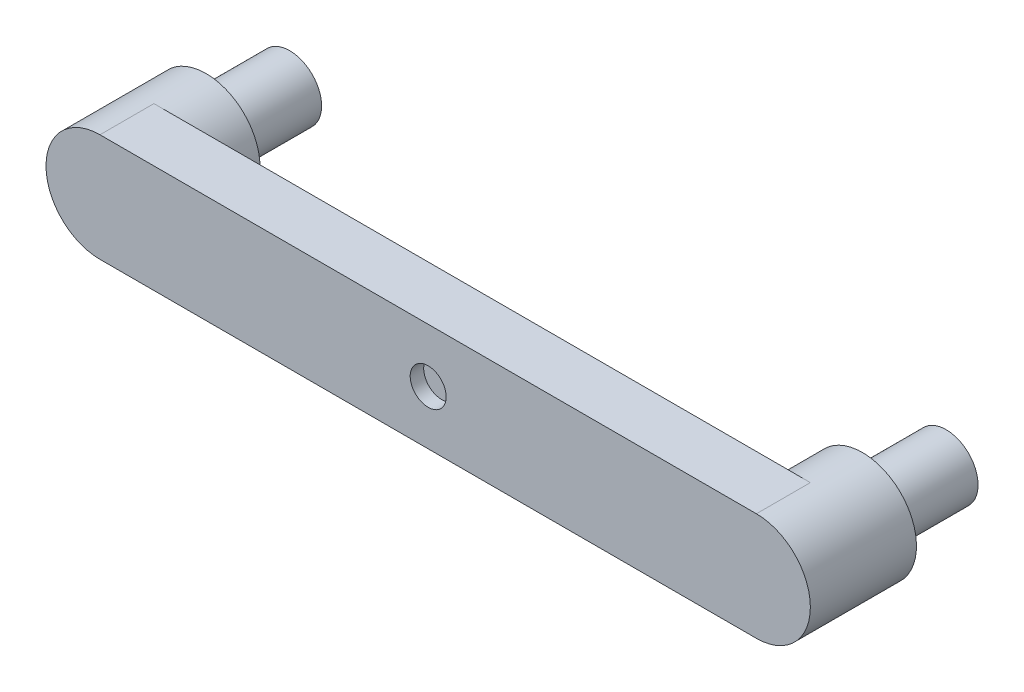
ISO-10303-21;
HEADER;
FILE_DESCRIPTION(('STEP AP214'),'2;1');
FILE_NAME('part.step','',(''),(''),'','','');
FILE_SCHEMA(('AUTOMOTIVE_DESIGN { 1 0 10303 214 1 1 1 1 }'));
ENDSEC;
DATA;
#1=APPLICATION_CONTEXT('core data for automotive mechanical design processes');
#2=APPLICATION_PROTOCOL_DEFINITION('international standard','automotive_design',2000,#1);
#3=PRODUCT_CONTEXT('',#1,'mechanical');
#4=PRODUCT('Part','Part','',(#3));
#5=PRODUCT_RELATED_PRODUCT_CATEGORY('part','',(#4));
#6=PRODUCT_DEFINITION_FORMATION('','',#4);
#7=PRODUCT_DEFINITION_CONTEXT('part definition',#1,'design');
#8=PRODUCT_DEFINITION('design','',#6,#7);
#9=PRODUCT_DEFINITION_SHAPE('','',#8);
#10=(LENGTH_UNIT() NAMED_UNIT(*) SI_UNIT(.MILLI.,.METRE.));
#11=(NAMED_UNIT(*) PLANE_ANGLE_UNIT() SI_UNIT($,.RADIAN.));
#12=(NAMED_UNIT(*) SI_UNIT($,.STERADIAN.) SOLID_ANGLE_UNIT());
#13=UNCERTAINTY_MEASURE_WITH_UNIT(LENGTH_MEASURE(1.E-05),#10,'distance_accuracy_value','');
#14=(GEOMETRIC_REPRESENTATION_CONTEXT(3) GLOBAL_UNCERTAINTY_ASSIGNED_CONTEXT((#13)) GLOBAL_UNIT_ASSIGNED_CONTEXT((#10,
#11,#12)) REPRESENTATION_CONTEXT('',''));
#15=CARTESIAN_POINT('',(0.,0.,0.));
#16=DIRECTION('',(0.,0.,1.));
#17=DIRECTION('',(1.,0.,0.));
#18=AXIS2_PLACEMENT_3D('',#15,#16,#17);
#19=CARTESIAN_POINT('',(0.,0.,-58.2842712474619));
#20=DIRECTION('',(0.,0.,1.));
#21=DIRECTION('',(1.,0.,0.));
#22=AXIS2_PLACEMENT_3D('',#19,#20,#21);
#23=CYLINDRICAL_SURFACE('',#22,10.);
#24=CARTESIAN_POINT('',(0.,0.,-7.50000000000001));
#25=DIRECTION('',(0.,0.,1.));
#26=DIRECTION('',(1.,0.,0.));
#27=AXIS2_PLACEMENT_3D('',#24,#25,#26);
#28=CIRCLE('',#27,10.);
#29=CARTESIAN_POINT('',(10.,0.,-7.50000000000001));
#30=VERTEX_POINT('',#29);
#31=EDGE_CURVE('E45',#30,#30,#28,.F.);
#32=ORIENTED_EDGE('',*,*,#31,.T.);
#33=EDGE_LOOP('',(#32));
#34=FACE_BOUND('',#33,.T.);
#35=CARTESIAN_POINT('',(0.,0.,0.));
#36=DIRECTION('',(0.,0.,1.));
#37=DIRECTION('',(1.,0.,0.));
#38=AXIS2_PLACEMENT_3D('',#35,#36,#37);
#39=CIRCLE('',#38,10.);
#40=CARTESIAN_POINT('',(10.,0.,0.));
#41=VERTEX_POINT('',#40);
#42=EDGE_CURVE('E170',#41,#41,#39,.T.);
#43=ORIENTED_EDGE('',*,*,#42,.T.);
#44=EDGE_LOOP('',(#43));
#45=FACE_BOUND('',#44,.T.);
#46=ADVANCED_FACE('F41',(#34,#45),#23,.F.);
#47=CARTESIAN_POINT('',(0.,-30.,-30.));
#48=DIRECTION('',(0.,-1.,0.));
#49=DIRECTION('',(1.,0.,0.));
#50=AXIS2_PLACEMENT_3D('',#47,#48,#49);
#51=PLANE('',#50);
#52=DIRECTION('',(0.,0.,-1.));
#53=VECTOR('',#52,1.);
#54=CARTESIAN_POINT('',(-30.,-30.,-22.5));
#55=LINE('',#54,#53);
#56=CARTESIAN_POINT('',(-30.,-30.,-7.50000000000001));
#57=VERTEX_POINT('',#56);
#58=CARTESIAN_POINT('',(-30.,-30.,-22.5));
#59=VERTEX_POINT('',#58);
#60=EDGE_CURVE('E59',#57,#59,#55,.T.);
#61=ORIENTED_EDGE('',*,*,#60,.F.);
#62=DIRECTION('',(-1.,0.,0.));
#63=VECTOR('',#62,1.);
#64=CARTESIAN_POINT('',(-30.,-30.,-7.50000000000001));
#65=LINE('',#64,#63);
#66=CARTESIAN_POINT('',(30.,-30.,-7.50000000000001));
#67=VERTEX_POINT('',#66);
#68=EDGE_CURVE('E153',#67,#57,#65,.T.);
#69=ORIENTED_EDGE('',*,*,#68,.F.);
#70=DIRECTION('',(0.,0.,1.));
#71=VECTOR('',#70,1.);
#72=CARTESIAN_POINT('',(30.,-30.,-22.5));
#73=LINE('',#72,#71);
#74=CARTESIAN_POINT('',(30.,-30.,-22.5));
#75=VERTEX_POINT('',#74);
#76=EDGE_CURVE('E242',#75,#67,#73,.T.);
#77=ORIENTED_EDGE('',*,*,#76,.F.);
#78=DIRECTION('',(1.,0.,0.));
#79=VECTOR('',#78,1.);
#80=CARTESIAN_POINT('',(-30.,-30.,-22.5));
#81=LINE('',#80,#79);
#82=EDGE_CURVE('E250',#59,#75,#81,.T.);
#83=ORIENTED_EDGE('',*,*,#82,.F.);
#84=EDGE_LOOP('',(#61,#69,#77,#83));
#85=FACE_BOUND('',#84,.T.);
#86=DIRECTION('',(1.,0.,0.));
#87=VECTOR('',#86,1.);
#88=CARTESIAN_POINT('',(0.,-30.,0.));
#89=LINE('',#88,#87);
#90=CARTESIAN_POINT('',(-182.5,-30.,0.));
#91=VERTEX_POINT('',#90);
#92=CARTESIAN_POINT('',(182.5,-29.9999999999999,0.));
#93=VERTEX_POINT('',#92);
#94=EDGE_CURVE('E102',#91,#93,#89,.T.);
#95=ORIENTED_EDGE('',*,*,#94,.F.);
#96=DIRECTION('',(0.,0.,1.));
#97=VECTOR('',#96,1.);
#98=CARTESIAN_POINT('',(-182.5,-30.,-30.));
#99=LINE('',#98,#97);
#100=CARTESIAN_POINT('',(-182.5,-30.,-30.));
#101=VERTEX_POINT('',#100);
#102=EDGE_CURVE('E88',#101,#91,#99,.T.);
#103=ORIENTED_EDGE('',*,*,#102,.F.);
#104=DIRECTION('',(1.,0.,0.));
#105=VECTOR('',#104,1.);
#106=CARTESIAN_POINT('',(0.,-30.,-30.));
#107=LINE('',#106,#105);
#108=CARTESIAN_POINT('',(182.5,-29.9999999999999,-30.));
#109=VERTEX_POINT('',#108);
#110=EDGE_CURVE('E117',#101,#109,#107,.T.);
#111=ORIENTED_EDGE('',*,*,#110,.T.);
#112=DIRECTION('',(0.,0.,1.));
#113=VECTOR('',#112,1.);
#114=CARTESIAN_POINT('',(182.5,-29.9999999999999,-30.));
#115=LINE('',#114,#113);
#116=EDGE_CURVE('E104',#109,#93,#115,.T.);
#117=ORIENTED_EDGE('',*,*,#116,.T.);
#118=EDGE_LOOP('',(#95,#103,#111,#117));
#119=FACE_BOUND('',#118,.T.);
#120=ADVANCED_FACE('F43',(#85,#119),#51,.T.);
#121=CARTESIAN_POINT('',(-182.5,0.,-30.));
#122=DIRECTION('',(0.,0.,1.));
#123=DIRECTION('',(1.,0.,0.));
#124=AXIS2_PLACEMENT_3D('',#121,#122,#123);
#125=CYLINDRICAL_SURFACE('',#124,30.);
#126=CARTESIAN_POINT('',(-182.5,0.,0.));
#127=DIRECTION('',(0.,0.,1.));
#128=DIRECTION('',(1.,0.,0.));
#129=AXIS2_PLACEMENT_3D('',#126,#127,#128);
#130=CIRCLE('',#129,30.);
#131=CARTESIAN_POINT('',(-182.5,30.,0.));
#132=VERTEX_POINT('',#131);
#133=EDGE_CURVE('E93',#132,#91,#130,.T.);
#134=ORIENTED_EDGE('',*,*,#133,.F.);
#135=DIRECTION('',(0.,0.,1.));
#136=VECTOR('',#135,1.);
#137=CARTESIAN_POINT('',(-182.5,30.,-30.));
#138=LINE('',#137,#136);
#139=CARTESIAN_POINT('',(-182.5,30.,-30.));
#140=VERTEX_POINT('',#139);
#141=EDGE_CURVE('E99',#140,#132,#138,.T.);
#142=ORIENTED_EDGE('',*,*,#141,.F.);
#143=CARTESIAN_POINT('',(-182.5,0.,-30.));
#144=DIRECTION('',(0.,0.,-1.));
#145=DIRECTION('',(-1.,0.,0.));
#146=AXIS2_PLACEMENT_3D('',#143,#144,#145);
#147=CIRCLE('',#146,30.);
#148=EDGE_CURVE('E68',#140,#101,#147,.T.);
#149=ORIENTED_EDGE('',*,*,#148,.T.);
#150=ORIENTED_EDGE('',*,*,#102,.T.);
#151=EDGE_LOOP('',(#134,#142,#149,#150));
#152=FACE_BOUND('',#151,.T.);
#153=CARTESIAN_POINT('',(-182.5,0.,-59.));
#154=DIRECTION('',(0.,0.,-1.));
#155=DIRECTION('',(-1.,0.,0.));
#156=AXIS2_PLACEMENT_3D('',#153,#154,#155);
#157=CIRCLE('',#156,30.);
#158=CARTESIAN_POINT('',(-212.5,0.,-59.));
#159=VERTEX_POINT('',#158);
#160=EDGE_CURVE('E181',#159,#159,#157,.T.);
#161=ORIENTED_EDGE('',*,*,#160,.F.);
#162=EDGE_LOOP('',(#161));
#163=FACE_BOUND('',#162,.T.);
#164=ADVANCED_FACE('F90',(#152,#163),#125,.T.);
#165=CARTESIAN_POINT('',(0.,30.,-30.));
#166=DIRECTION('',(0.,-1.,0.));
#167=DIRECTION('',(1.,0.,0.));
#168=AXIS2_PLACEMENT_3D('',#165,#166,#167);
#169=PLANE('',#168);
#170=DIRECTION('',(1.,0.,0.));
#171=VECTOR('',#170,1.);
#172=CARTESIAN_POINT('',(0.,30.,0.));
#173=LINE('',#172,#171);
#174=CARTESIAN_POINT('',(182.5,30.0000000000001,0.));
#175=VERTEX_POINT('',#174);
#176=EDGE_CURVE('E115',#132,#175,#173,.T.);
#177=ORIENTED_EDGE('',*,*,#176,.T.);
#178=DIRECTION('',(0.,0.,1.));
#179=VECTOR('',#178,1.);
#180=CARTESIAN_POINT('',(182.5,30.0000000000001,-30.));
#181=LINE('',#180,#179);
#182=CARTESIAN_POINT('',(182.5,30.0000000000001,-30.));
#183=VERTEX_POINT('',#182);
#184=EDGE_CURVE('E128',#183,#175,#181,.T.);
#185=ORIENTED_EDGE('',*,*,#184,.F.);
#186=DIRECTION('',(1.,0.,0.));
#187=VECTOR('',#186,1.);
#188=CARTESIAN_POINT('',(0.,30.,-30.));
#189=LINE('',#188,#187);
#190=EDGE_CURVE('E121',#140,#183,#189,.T.);
#191=ORIENTED_EDGE('',*,*,#190,.F.);
#192=ORIENTED_EDGE('',*,*,#141,.T.);
#193=EDGE_LOOP('',(#177,#185,#191,#192));
#194=FACE_BOUND('',#193,.T.);
#195=ADVANCED_FACE('F201',(#194),#169,.F.);
#196=CARTESIAN_POINT('',(182.5,0.,-30.));
#197=DIRECTION('',(0.,0.,1.));
#198=DIRECTION('',(1.,0.,0.));
#199=AXIS2_PLACEMENT_3D('',#196,#197,#198);
#200=CYLINDRICAL_SURFACE('',#199,30.);
#201=CARTESIAN_POINT('',(182.5,0.,0.));
#202=DIRECTION('',(0.,0.,1.));
#203=DIRECTION('',(1.,0.,0.));
#204=AXIS2_PLACEMENT_3D('',#201,#202,#203);
#205=CIRCLE('',#204,30.);
#206=EDGE_CURVE('E109',#93,#175,#205,.T.);
#207=ORIENTED_EDGE('',*,*,#206,.F.);
#208=ORIENTED_EDGE('',*,*,#116,.F.);
#209=CARTESIAN_POINT('',(182.5,0.,-30.));
#210=DIRECTION('',(0.,0.,-1.));
#211=DIRECTION('',(-1.,0.,0.));
#212=AXIS2_PLACEMENT_3D('',#209,#210,#211);
#213=CIRCLE('',#212,30.);
#214=EDGE_CURVE('E98',#109,#183,#213,.T.);
#215=ORIENTED_EDGE('',*,*,#214,.T.);
#216=ORIENTED_EDGE('',*,*,#184,.T.);
#217=EDGE_LOOP('',(#207,#208,#215,#216));
#218=FACE_BOUND('',#217,.T.);
#219=CARTESIAN_POINT('',(182.5,0.,-59.));
#220=DIRECTION('',(0.,0.,-1.));
#221=DIRECTION('',(-1.,0.,0.));
#222=AXIS2_PLACEMENT_3D('',#219,#220,#221);
#223=CIRCLE('',#222,30.);
#224=CARTESIAN_POINT('',(152.5,0.,-59.));
#225=VERTEX_POINT('',#224);
#226=EDGE_CURVE('E110',#225,#225,#223,.T.);
#227=ORIENTED_EDGE('',*,*,#226,.F.);
#228=EDGE_LOOP('',(#227));
#229=FACE_BOUND('',#228,.T.);
#230=ADVANCED_FACE('F196',(#218,#229),#200,.T.);
#231=CARTESIAN_POINT('',(0.,0.,-30.));
#232=DIRECTION('',(0.,0.,1.));
#233=DIRECTION('',(1.,0.,0.));
#234=AXIS2_PLACEMENT_3D('',#231,#232,#233);
#235=PLANE('',#234);
#236=CARTESIAN_POINT('',(0.,0.,-30.));
#237=DIRECTION('',(0.,0.,1.));
#238=DIRECTION('',(1.,0.,0.));
#239=AXIS2_PLACEMENT_3D('',#236,#237,#238);
#240=CIRCLE('',#239,10.);
#241=CARTESIAN_POINT('',(10.,0.,-30.));
#242=VERTEX_POINT('',#241);
#243=EDGE_CURVE('E177',#242,#242,#240,.F.);
#244=ORIENTED_EDGE('',*,*,#243,.F.);
#245=EDGE_LOOP('',(#244));
#246=FACE_BOUND('',#245,.T.);
#247=ORIENTED_EDGE('',*,*,#148,.F.);
#248=ORIENTED_EDGE('',*,*,#190,.T.);
#249=ORIENTED_EDGE('',*,*,#214,.F.);
#250=ORIENTED_EDGE('',*,*,#110,.F.);
#251=EDGE_LOOP('',(#247,#248,#249,#250));
#252=FACE_BOUND('',#251,.T.);
#253=ADVANCED_FACE('F202',(#246,#252),#235,.F.);
#254=CARTESIAN_POINT('',(0.,0.,0.));
#255=DIRECTION('',(0.,0.,1.));
#256=DIRECTION('',(1.,0.,0.));
#257=AXIS2_PLACEMENT_3D('',#254,#255,#256);
#258=PLANE('',#257);
#259=ORIENTED_EDGE('',*,*,#42,.F.);
#260=EDGE_LOOP('',(#259));
#261=FACE_BOUND('',#260,.T.);
#262=ORIENTED_EDGE('',*,*,#94,.T.);
#263=ORIENTED_EDGE('',*,*,#206,.T.);
#264=ORIENTED_EDGE('',*,*,#176,.F.);
#265=ORIENTED_EDGE('',*,*,#133,.T.);
#266=EDGE_LOOP('',(#262,#263,#264,#265));
#267=FACE_BOUND('',#266,.T.);
#268=ADVANCED_FACE('F113',(#261,#267),#258,.T.);
#269=CARTESIAN_POINT('',(182.5,0.,-59.));
#270=DIRECTION('',(0.,0.,-1.));
#271=DIRECTION('',(-1.,0.,0.));
#272=AXIS2_PLACEMENT_3D('',#269,#270,#271);
#273=PLANE('',#272);
#274=CARTESIAN_POINT('',(182.5,0.,-59.));
#275=DIRECTION('',(0.,0.,-1.));
#276=DIRECTION('',(-1.,0.,0.));
#277=AXIS2_PLACEMENT_3D('',#274,#275,#276);
#278=CIRCLE('',#277,17.75);
#279=CARTESIAN_POINT('',(164.75,0.,-59.));
#280=VERTEX_POINT('',#279);
#281=EDGE_CURVE('E51',#280,#280,#278,.T.);
#282=ORIENTED_EDGE('',*,*,#281,.F.);
#283=EDGE_LOOP('',(#282));
#284=FACE_BOUND('',#283,.T.);
#285=ORIENTED_EDGE('',*,*,#226,.T.);
#286=EDGE_LOOP('',(#285));
#287=FACE_BOUND('',#286,.T.);
#288=ADVANCED_FACE('F274',(#284,#287),#273,.T.);
#289=CARTESIAN_POINT('',(-182.5,0.,-59.));
#290=DIRECTION('',(0.,0.,-1.));
#291=DIRECTION('',(-1.,0.,0.));
#292=AXIS2_PLACEMENT_3D('',#289,#290,#291);
#293=PLANE('',#292);
#294=CARTESIAN_POINT('',(-182.5,0.,-59.));
#295=DIRECTION('',(0.,0.,-1.));
#296=DIRECTION('',(-1.,0.,0.));
#297=AXIS2_PLACEMENT_3D('',#294,#295,#296);
#298=CIRCLE('',#297,17.75);
#299=CARTESIAN_POINT('',(-200.25,0.,-59.));
#300=VERTEX_POINT('',#299);
#301=EDGE_CURVE('E11',#300,#300,#298,.T.);
#302=ORIENTED_EDGE('',*,*,#301,.F.);
#303=EDGE_LOOP('',(#302));
#304=FACE_BOUND('',#303,.T.);
#305=ORIENTED_EDGE('',*,*,#160,.T.);
#306=EDGE_LOOP('',(#305));
#307=FACE_BOUND('',#306,.T.);
#308=ADVANCED_FACE('F280',(#304,#307),#293,.T.);
#309=CARTESIAN_POINT('',(0.,0.,-22.5));
#310=DIRECTION('',(0.,0.,-1.));
#311=DIRECTION('',(-1.,0.,0.));
#312=AXIS2_PLACEMENT_3D('',#309,#310,#311);
#313=CIRCLE('',#312,10.);
#314=CARTESIAN_POINT('',(-10.,0.,-22.5));
#315=VERTEX_POINT('',#314);
#316=EDGE_CURVE('E132',#315,#315,#313,.F.);
#317=ORIENTED_EDGE('',*,*,#316,.T.);
#318=EDGE_LOOP('',(#317));
#319=FACE_BOUND('',#318,.T.);
#320=ORIENTED_EDGE('',*,*,#243,.T.);
#321=EDGE_LOOP('',(#320));
#322=FACE_BOUND('',#321,.T.);
#323=ADVANCED_FACE('F270',(#319,#322),#23,.F.);
#324=CARTESIAN_POINT('',(182.5,0.,-105.5));
#325=DIRECTION('',(0.,0.,1.));
#326=DIRECTION('',(1.,0.,0.));
#327=AXIS2_PLACEMENT_3D('',#324,#325,#326);
#328=CYLINDRICAL_SURFACE('',#327,17.75);
#329=CARTESIAN_POINT('',(182.5,0.,-105.5));
#330=DIRECTION('',(0.,0.,-1.));
#331=DIRECTION('',(-1.,0.,0.));
#332=AXIS2_PLACEMENT_3D('',#329,#330,#331);
#333=CIRCLE('',#332,17.75);
#334=CARTESIAN_POINT('',(164.75,0.,-105.5));
#335=VERTEX_POINT('',#334);
#336=EDGE_CURVE('E165',#335,#335,#333,.T.);
#337=ORIENTED_EDGE('',*,*,#336,.F.);
#338=EDGE_LOOP('',(#337));
#339=FACE_BOUND('',#338,.T.);
#340=ORIENTED_EDGE('',*,*,#281,.T.);
#341=EDGE_LOOP('',(#340));
#342=FACE_BOUND('',#341,.T.);
#343=ADVANCED_FACE('F326',(#339,#342),#328,.T.);
#344=CARTESIAN_POINT('',(182.5,0.,-105.5));
#345=DIRECTION('',(0.,0.,-1.));
#346=DIRECTION('',(-1.,0.,0.));
#347=AXIS2_PLACEMENT_3D('',#344,#345,#346);
#348=PLANE('',#347);
#349=ORIENTED_EDGE('',*,*,#336,.T.);
#350=EDGE_LOOP('',(#349));
#351=FACE_BOUND('',#350,.T.);
#352=ADVANCED_FACE('F331',(#351),#348,.T.);
#353=CARTESIAN_POINT('',(-182.5,0.,-105.5));
#354=DIRECTION('',(0.,0.,1.));
#355=DIRECTION('',(1.,0.,0.));
#356=AXIS2_PLACEMENT_3D('',#353,#354,#355);
#357=CYLINDRICAL_SURFACE('',#356,17.75);
#358=CARTESIAN_POINT('',(-182.5,0.,-105.5));
#359=DIRECTION('',(0.,0.,-1.));
#360=DIRECTION('',(-1.,0.,0.));
#361=AXIS2_PLACEMENT_3D('',#358,#359,#360);
#362=CIRCLE('',#361,17.75);
#363=CARTESIAN_POINT('',(-200.25,0.,-105.5));
#364=VERTEX_POINT('',#363);
#365=EDGE_CURVE('E141',#364,#364,#362,.T.);
#366=ORIENTED_EDGE('',*,*,#365,.F.);
#367=EDGE_LOOP('',(#366));
#368=FACE_BOUND('',#367,.T.);
#369=ORIENTED_EDGE('',*,*,#301,.T.);
#370=EDGE_LOOP('',(#369));
#371=FACE_BOUND('',#370,.T.);
#372=ADVANCED_FACE('F341',(#368,#371),#357,.T.);
#373=CARTESIAN_POINT('',(-182.5,0.,-105.5));
#374=DIRECTION('',(0.,0.,-1.));
#375=DIRECTION('',(-1.,0.,0.));
#376=AXIS2_PLACEMENT_3D('',#373,#374,#375);
#377=PLANE('',#376);
#378=ORIENTED_EDGE('',*,*,#365,.T.);
#379=EDGE_LOOP('',(#378));
#380=FACE_BOUND('',#379,.T.);
#381=ADVANCED_FACE('F263',(#380),#377,.T.);
#382=CARTESIAN_POINT('',(-30.,15.,-7.50000000000001));
#383=DIRECTION('',(0.,0.,1.));
#384=DIRECTION('',(1.,0.,0.));
#385=AXIS2_PLACEMENT_3D('',#382,#383,#384);
#386=PLANE('',#385);
#387=ORIENTED_EDGE('',*,*,#68,.T.);
#388=DIRECTION('',(0.,-1.,0.));
#389=VECTOR('',#388,1.);
#390=CARTESIAN_POINT('',(-30.,15.,-7.50000000000001));
#391=LINE('',#390,#389);
#392=CARTESIAN_POINT('',(-30.,15.,-7.50000000000001));
#393=VERTEX_POINT('',#392);
#394=EDGE_CURVE('E135',#393,#57,#391,.T.);
#395=ORIENTED_EDGE('',*,*,#394,.F.);
#396=DIRECTION('',(-1.,0.,0.));
#397=VECTOR('',#396,1.);
#398=CARTESIAN_POINT('',(-30.,15.,-7.50000000000001));
#399=LINE('',#398,#397);
#400=CARTESIAN_POINT('',(30.,15.,-7.50000000000001));
#401=VERTEX_POINT('',#400);
#402=EDGE_CURVE('E162',#401,#393,#399,.T.);
#403=ORIENTED_EDGE('',*,*,#402,.F.);
#404=DIRECTION('',(0.,-1.,0.));
#405=VECTOR('',#404,1.);
#406=CARTESIAN_POINT('',(30.,15.,-7.50000000000001));
#407=LINE('',#406,#405);
#408=EDGE_CURVE('E142',#401,#67,#407,.T.);
#409=ORIENTED_EDGE('',*,*,#408,.T.);
#410=EDGE_LOOP('',(#387,#395,#403,#409));
#411=FACE_BOUND('',#410,.T.);
#412=ORIENTED_EDGE('',*,*,#31,.F.);
#413=EDGE_LOOP('',(#412));
#414=FACE_BOUND('',#413,.T.);
#415=ADVANCED_FACE('F260',(#411,#414),#386,.F.);
#416=CARTESIAN_POINT('',(-30.,15.,-22.5));
#417=DIRECTION('',(0.,0.,-1.));
#418=DIRECTION('',(-1.,0.,0.));
#419=AXIS2_PLACEMENT_3D('',#416,#417,#418);
#420=PLANE('',#419);
#421=ORIENTED_EDGE('',*,*,#82,.T.);
#422=DIRECTION('',(0.,-1.,0.));
#423=VECTOR('',#422,1.);
#424=CARTESIAN_POINT('',(30.,15.,-22.5));
#425=LINE('',#424,#423);
#426=CARTESIAN_POINT('',(30.,15.,-22.5));
#427=VERTEX_POINT('',#426);
#428=EDGE_CURVE('E150',#427,#75,#425,.T.);
#429=ORIENTED_EDGE('',*,*,#428,.F.);
#430=DIRECTION('',(1.,0.,0.));
#431=VECTOR('',#430,1.);
#432=CARTESIAN_POINT('',(-30.,15.,-22.5));
#433=LINE('',#432,#431);
#434=CARTESIAN_POINT('',(-30.,15.,-22.5));
#435=VERTEX_POINT('',#434);
#436=EDGE_CURVE('E228',#435,#427,#433,.T.);
#437=ORIENTED_EDGE('',*,*,#436,.F.);
#438=DIRECTION('',(0.,-1.,0.));
#439=VECTOR('',#438,1.);
#440=CARTESIAN_POINT('',(-30.,15.,-22.5));
#441=LINE('',#440,#439);
#442=EDGE_CURVE('E159',#435,#59,#441,.T.);
#443=ORIENTED_EDGE('',*,*,#442,.T.);
#444=EDGE_LOOP('',(#421,#429,#437,#443));
#445=FACE_BOUND('',#444,.T.);
#446=ORIENTED_EDGE('',*,*,#316,.F.);
#447=EDGE_LOOP('',(#446));
#448=FACE_BOUND('',#447,.T.);
#449=ADVANCED_FACE('F229',(#445,#448),#420,.F.);
#450=CARTESIAN_POINT('',(-30.,15.,-22.5));
#451=DIRECTION('',(-1.,0.,0.));
#452=DIRECTION('',(0.,-1.,0.));
#453=AXIS2_PLACEMENT_3D('',#450,#451,#452);
#454=PLANE('',#453);
#455=ORIENTED_EDGE('',*,*,#60,.T.);
#456=ORIENTED_EDGE('',*,*,#442,.F.);
#457=DIRECTION('',(0.,0.,-1.));
#458=VECTOR('',#457,1.);
#459=CARTESIAN_POINT('',(-30.,15.,-22.5));
#460=LINE('',#459,#458);
#461=EDGE_CURVE('E222',#393,#435,#460,.T.);
#462=ORIENTED_EDGE('',*,*,#461,.F.);
#463=ORIENTED_EDGE('',*,*,#394,.T.);
#464=EDGE_LOOP('',(#455,#456,#462,#463));
#465=FACE_BOUND('',#464,.T.);
#466=ADVANCED_FACE('F220',(#465),#454,.F.);
#467=CARTESIAN_POINT('',(30.,15.,-22.5));
#468=DIRECTION('',(1.,0.,0.));
#469=DIRECTION('',(0.,1.,0.));
#470=AXIS2_PLACEMENT_3D('',#467,#468,#469);
#471=PLANE('',#470);
#472=ORIENTED_EDGE('',*,*,#76,.T.);
#473=ORIENTED_EDGE('',*,*,#408,.F.);
#474=DIRECTION('',(0.,0.,1.));
#475=VECTOR('',#474,1.);
#476=CARTESIAN_POINT('',(30.,15.,-22.5));
#477=LINE('',#476,#475);
#478=EDGE_CURVE('E235',#427,#401,#477,.T.);
#479=ORIENTED_EDGE('',*,*,#478,.F.);
#480=ORIENTED_EDGE('',*,*,#428,.T.);
#481=EDGE_LOOP('',(#472,#473,#479,#480));
#482=FACE_BOUND('',#481,.T.);
#483=ADVANCED_FACE('F257',(#482),#471,.F.);
#484=CARTESIAN_POINT('',(0.,15.,0.));
#485=DIRECTION('',(0.,1.,0.));
#486=DIRECTION('',(-1.,0.,0.));
#487=AXIS2_PLACEMENT_3D('',#484,#485,#486);
#488=PLANE('',#487);
#489=ORIENTED_EDGE('',*,*,#461,.T.);
#490=ORIENTED_EDGE('',*,*,#436,.T.);
#491=ORIENTED_EDGE('',*,*,#478,.T.);
#492=ORIENTED_EDGE('',*,*,#402,.T.);
#493=EDGE_LOOP('',(#489,#490,#491,#492));
#494=FACE_BOUND('',#493,.T.);
#495=ADVANCED_FACE('F237',(#494),#488,.F.);
#496=CLOSED_SHELL('',(#46,#120,#164,#195,#230,#253,#268,#288,#308,#323,#343,#352,#372,#381,#415,
#449,#466,#483,#495));
#497=MANIFOLD_SOLID_BREP('B2',#496);
#498=ADVANCED_BREP_SHAPE_REPRESENTATION('',(#18,#497),#14);
#499=SHAPE_DEFINITION_REPRESENTATION(#9,#498);
ENDSEC;
END-ISO-10303-21;
